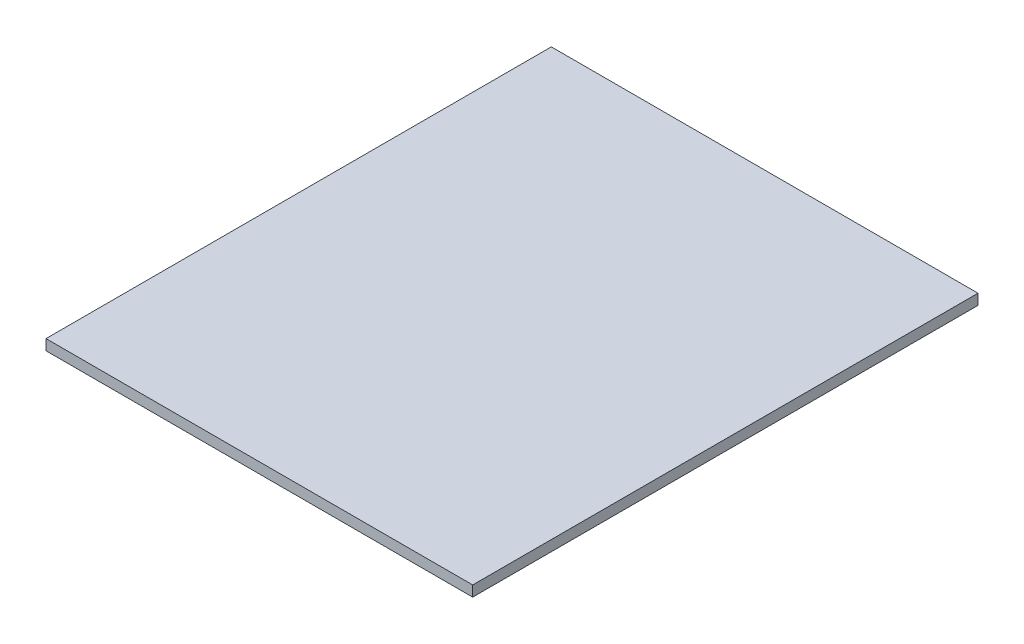
ISO-10303-21;
HEADER;
FILE_DESCRIPTION(('STEP AP214'),'2;1');
FILE_NAME('part.step','',(''),(''),'','','');
FILE_SCHEMA(('AUTOMOTIVE_DESIGN { 1 0 10303 214 1 1 1 1 }'));
ENDSEC;
DATA;
#1=APPLICATION_CONTEXT('core data for automotive mechanical design processes');
#2=APPLICATION_PROTOCOL_DEFINITION('international standard','automotive_design',2000,#1);
#3=PRODUCT_CONTEXT('',#1,'mechanical');
#4=PRODUCT('Part','Part','',(#3));
#5=PRODUCT_RELATED_PRODUCT_CATEGORY('part','',(#4));
#6=PRODUCT_DEFINITION_FORMATION('','',#4);
#7=PRODUCT_DEFINITION_CONTEXT('part definition',#1,'design');
#8=PRODUCT_DEFINITION('design','',#6,#7);
#9=PRODUCT_DEFINITION_SHAPE('','',#8);
#10=(LENGTH_UNIT() NAMED_UNIT(*) SI_UNIT(.MILLI.,.METRE.));
#11=(NAMED_UNIT(*) PLANE_ANGLE_UNIT() SI_UNIT($,.RADIAN.));
#12=(NAMED_UNIT(*) SI_UNIT($,.STERADIAN.) SOLID_ANGLE_UNIT());
#13=UNCERTAINTY_MEASURE_WITH_UNIT(LENGTH_MEASURE(1.E-05),#10,'distance_accuracy_value','');
#14=(GEOMETRIC_REPRESENTATION_CONTEXT(3) GLOBAL_UNCERTAINTY_ASSIGNED_CONTEXT((#13)) GLOBAL_UNIT_ASSIGNED_CONTEXT((#10,
#11,#12)) REPRESENTATION_CONTEXT('',''));
#15=CARTESIAN_POINT('',(0.,0.,0.));
#16=DIRECTION('',(0.,0.,1.));
#17=DIRECTION('',(1.,0.,0.));
#18=AXIS2_PLACEMENT_3D('',#15,#16,#17);
#19=CARTESIAN_POINT('',(60.452,1.4986,71.5899));
#20=DIRECTION('',(-1.,0.,0.));
#21=DIRECTION('',(0.,0.,1.));
#22=AXIS2_PLACEMENT_3D('',#19,#20,#21);
#23=PLANE('',#22);
#24=DIRECTION('',(0.,0.,-1.));
#25=VECTOR('',#24,1.);
#26=CARTESIAN_POINT('',(60.452,-1.4986,71.5899));
#27=LINE('',#26,#25);
#28=CARTESIAN_POINT('',(60.452,-1.4986,71.5899));
#29=VERTEX_POINT('',#28);
#30=CARTESIAN_POINT('',(60.452,-1.4986,-71.5899));
#31=VERTEX_POINT('',#30);
#32=EDGE_CURVE('E95',#29,#31,#27,.T.);
#33=ORIENTED_EDGE('',*,*,#32,.T.);
#34=DIRECTION('',(0.,-1.,0.));
#35=VECTOR('',#34,1.);
#36=CARTESIAN_POINT('',(60.452,1.4986,-71.5899));
#37=LINE('',#36,#35);
#38=CARTESIAN_POINT('',(60.452,1.4986,-71.5899));
#39=VERTEX_POINT('',#38);
#40=EDGE_CURVE('E11',#39,#31,#37,.T.);
#41=ORIENTED_EDGE('',*,*,#40,.F.);
#42=DIRECTION('',(0.,0.,-1.));
#43=VECTOR('',#42,1.);
#44=CARTESIAN_POINT('',(60.452,1.4986,71.5899));
#45=LINE('',#44,#43);
#46=CARTESIAN_POINT('',(60.452,1.4986,71.5899));
#47=VERTEX_POINT('',#46);
#48=EDGE_CURVE('E83',#47,#39,#45,.T.);
#49=ORIENTED_EDGE('',*,*,#48,.F.);
#50=DIRECTION('',(0.,-1.,0.));
#51=VECTOR('',#50,1.);
#52=CARTESIAN_POINT('',(60.452,1.4986,71.5899));
#53=LINE('',#52,#51);
#54=EDGE_CURVE('E91',#47,#29,#53,.T.);
#55=ORIENTED_EDGE('',*,*,#54,.T.);
#56=EDGE_LOOP('',(#33,#41,#49,#55));
#57=FACE_BOUND('',#56,.T.);
#58=ADVANCED_FACE('F32',(#57),#23,.F.);
#59=CARTESIAN_POINT('',(-60.452,1.4986,-71.5899));
#60=DIRECTION('',(0.,0.,1.));
#61=DIRECTION('',(1.,0.,0.));
#62=AXIS2_PLACEMENT_3D('',#59,#60,#61);
#63=PLANE('',#62);
#64=DIRECTION('',(-1.,0.,0.));
#65=VECTOR('',#64,1.);
#66=CARTESIAN_POINT('',(-60.452,-1.4986,-71.5899));
#67=LINE('',#66,#65);
#68=CARTESIAN_POINT('',(-60.452,-1.4986,-71.5899));
#69=VERTEX_POINT('',#68);
#70=EDGE_CURVE('E87',#31,#69,#67,.T.);
#71=ORIENTED_EDGE('',*,*,#70,.T.);
#72=DIRECTION('',(0.,-1.,0.));
#73=VECTOR('',#72,1.);
#74=CARTESIAN_POINT('',(-60.452,1.4986,-71.5899));
#75=LINE('',#74,#73);
#76=CARTESIAN_POINT('',(-60.452,1.4986,-71.5899));
#77=VERTEX_POINT('',#76);
#78=EDGE_CURVE('E40',#77,#69,#75,.T.);
#79=ORIENTED_EDGE('',*,*,#78,.F.);
#80=DIRECTION('',(-1.,0.,0.));
#81=VECTOR('',#80,1.);
#82=CARTESIAN_POINT('',(-60.452,1.4986,-71.5899));
#83=LINE('',#82,#81);
#84=EDGE_CURVE('E78',#39,#77,#83,.T.);
#85=ORIENTED_EDGE('',*,*,#84,.F.);
#86=ORIENTED_EDGE('',*,*,#40,.T.);
#87=EDGE_LOOP('',(#71,#79,#85,#86));
#88=FACE_BOUND('',#87,.T.);
#89=ADVANCED_FACE('F86',(#88),#63,.F.);
#90=CARTESIAN_POINT('',(-60.452,1.4986,71.5899));
#91=DIRECTION('',(1.,0.,0.));
#92=DIRECTION('',(0.,0.,-1.));
#93=AXIS2_PLACEMENT_3D('',#90,#91,#92);
#94=PLANE('',#93);
#95=DIRECTION('',(0.,0.,1.));
#96=VECTOR('',#95,1.);
#97=CARTESIAN_POINT('',(-60.452,-1.4986,71.5899));
#98=LINE('',#97,#96);
#99=CARTESIAN_POINT('',(-60.452,-1.4986,71.5899));
#100=VERTEX_POINT('',#99);
#101=EDGE_CURVE('E65',#69,#100,#98,.T.);
#102=ORIENTED_EDGE('',*,*,#101,.T.);
#103=DIRECTION('',(0.,-1.,0.));
#104=VECTOR('',#103,1.);
#105=CARTESIAN_POINT('',(-60.452,1.4986,71.5899));
#106=LINE('',#105,#104);
#107=CARTESIAN_POINT('',(-60.452,1.4986,71.5899));
#108=VERTEX_POINT('',#107);
#109=EDGE_CURVE('E88',#108,#100,#106,.T.);
#110=ORIENTED_EDGE('',*,*,#109,.F.);
#111=DIRECTION('',(0.,0.,1.));
#112=VECTOR('',#111,1.);
#113=CARTESIAN_POINT('',(-60.452,1.4986,71.5899));
#114=LINE('',#113,#112);
#115=EDGE_CURVE('E81',#77,#108,#114,.T.);
#116=ORIENTED_EDGE('',*,*,#115,.F.);
#117=ORIENTED_EDGE('',*,*,#78,.T.);
#118=EDGE_LOOP('',(#102,#110,#116,#117));
#119=FACE_BOUND('',#118,.T.);
#120=ADVANCED_FACE('F89',(#119),#94,.F.);
#121=CARTESIAN_POINT('',(-60.452,1.4986,71.5899));
#122=DIRECTION('',(0.,0.,-1.));
#123=DIRECTION('',(-1.,0.,0.));
#124=AXIS2_PLACEMENT_3D('',#121,#122,#123);
#125=PLANE('',#124);
#126=DIRECTION('',(1.,0.,0.));
#127=VECTOR('',#126,1.);
#128=CARTESIAN_POINT('',(-60.452,-1.4986,71.5899));
#129=LINE('',#128,#127);
#130=EDGE_CURVE('E71',#100,#29,#129,.T.);
#131=ORIENTED_EDGE('',*,*,#130,.T.);
#132=ORIENTED_EDGE('',*,*,#54,.F.);
#133=DIRECTION('',(1.,0.,0.));
#134=VECTOR('',#133,1.);
#135=CARTESIAN_POINT('',(-60.452,1.4986,71.5899));
#136=LINE('',#135,#134);
#137=EDGE_CURVE('E48',#108,#47,#136,.T.);
#138=ORIENTED_EDGE('',*,*,#137,.F.);
#139=ORIENTED_EDGE('',*,*,#109,.T.);
#140=EDGE_LOOP('',(#131,#132,#138,#139));
#141=FACE_BOUND('',#140,.T.);
#142=ADVANCED_FACE('F102',(#141),#125,.F.);
#143=CARTESIAN_POINT('',(60.452,1.4986,-71.5899));
#144=DIRECTION('',(0.,-1.,0.));
#145=DIRECTION('',(0.,0.,-1.));
#146=AXIS2_PLACEMENT_3D('',#143,#144,#145);
#147=PLANE('',#146);
#148=ORIENTED_EDGE('',*,*,#48,.T.);
#149=ORIENTED_EDGE('',*,*,#84,.T.);
#150=ORIENTED_EDGE('',*,*,#115,.T.);
#151=ORIENTED_EDGE('',*,*,#137,.T.);
#152=EDGE_LOOP('',(#148,#149,#150,#151));
#153=FACE_BOUND('',#152,.T.);
#154=ADVANCED_FACE('F79',(#153),#147,.F.);
#155=CARTESIAN_POINT('',(60.452,-1.4986,-71.5899));
#156=DIRECTION('',(0.,-1.,0.));
#157=DIRECTION('',(0.,0.,-1.));
#158=AXIS2_PLACEMENT_3D('',#155,#156,#157);
#159=PLANE('',#158);
#160=ORIENTED_EDGE('',*,*,#32,.F.);
#161=ORIENTED_EDGE('',*,*,#130,.F.);
#162=ORIENTED_EDGE('',*,*,#101,.F.);
#163=ORIENTED_EDGE('',*,*,#70,.F.);
#164=EDGE_LOOP('',(#160,#161,#162,#163));
#165=FACE_BOUND('',#164,.T.);
#166=ADVANCED_FACE('F105',(#165),#159,.T.);
#167=CLOSED_SHELL('',(#58,#89,#120,#142,#154,#166));
#168=MANIFOLD_SOLID_BREP('B2',#167);
#169=ADVANCED_BREP_SHAPE_REPRESENTATION('',(#18,#168),#14);
#170=SHAPE_DEFINITION_REPRESENTATION(#9,#169);
ENDSEC;
END-ISO-10303-21;
